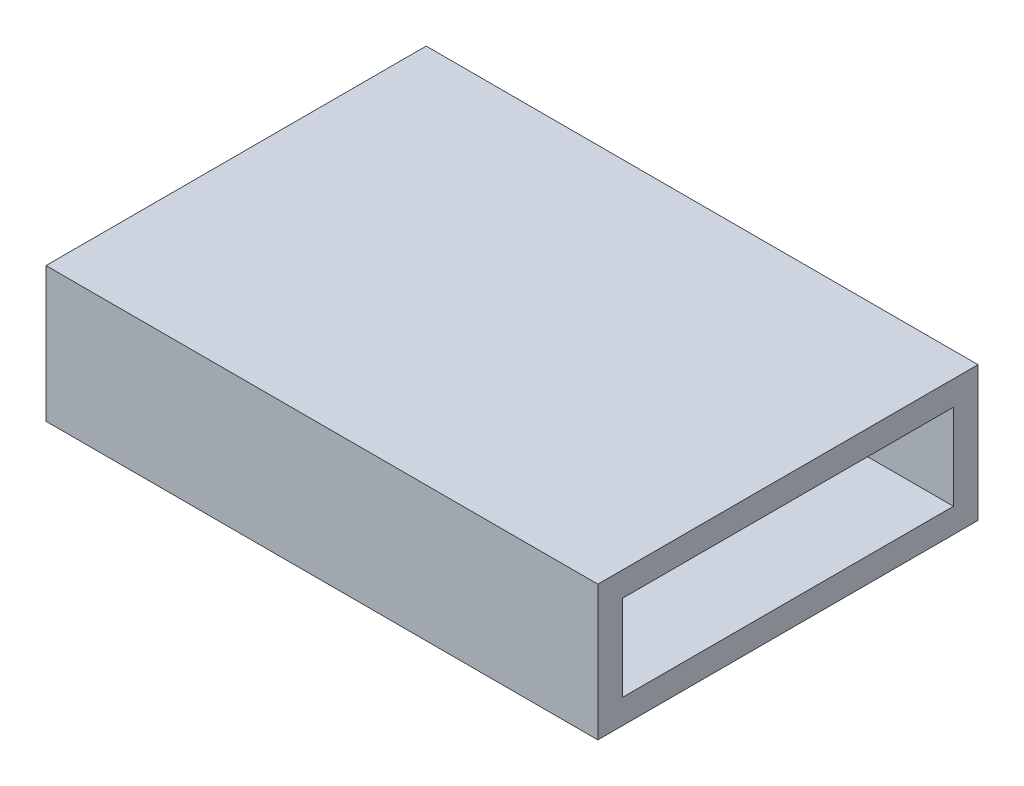
ISO-10303-21;
HEADER;
FILE_DESCRIPTION(('STEP AP214'),'2;1');
FILE_NAME('part.step','',(''),(''),'','','');
FILE_SCHEMA(('AUTOMOTIVE_DESIGN { 1 0 10303 214 1 1 1 1 }'));
ENDSEC;
DATA;
#1=APPLICATION_CONTEXT('core data for automotive mechanical design processes');
#2=APPLICATION_PROTOCOL_DEFINITION('international standard','automotive_design',2000,#1);
#3=PRODUCT_CONTEXT('',#1,'mechanical');
#4=PRODUCT('Part','Part','',(#3));
#5=PRODUCT_RELATED_PRODUCT_CATEGORY('part','',(#4));
#6=PRODUCT_DEFINITION_FORMATION('','',#4);
#7=PRODUCT_DEFINITION_CONTEXT('part definition',#1,'design');
#8=PRODUCT_DEFINITION('design','',#6,#7);
#9=PRODUCT_DEFINITION_SHAPE('','',#8);
#10=(LENGTH_UNIT() NAMED_UNIT(*) SI_UNIT(.MILLI.,.METRE.));
#11=(NAMED_UNIT(*) PLANE_ANGLE_UNIT() SI_UNIT($,.RADIAN.));
#12=(NAMED_UNIT(*) SI_UNIT($,.STERADIAN.) SOLID_ANGLE_UNIT());
#13=UNCERTAINTY_MEASURE_WITH_UNIT(LENGTH_MEASURE(1.E-05),#10,'distance_accuracy_value','');
#14=(GEOMETRIC_REPRESENTATION_CONTEXT(3) GLOBAL_UNCERTAINTY_ASSIGNED_CONTEXT((#13)) GLOBAL_UNIT_ASSIGNED_CONTEXT((#10,
#11,#12)) REPRESENTATION_CONTEXT('',''));
#15=CARTESIAN_POINT('',(0.,0.,0.));
#16=DIRECTION('',(0.,0.,1.));
#17=DIRECTION('',(1.,0.,0.));
#18=AXIS2_PLACEMENT_3D('',#15,#16,#17);
#19=CARTESIAN_POINT('',(-9.,0.,-5.4));
#20=DIRECTION('',(0.,0.,-1.));
#21=DIRECTION('',(-1.,0.,0.));
#22=AXIS2_PLACEMENT_3D('',#19,#20,#21);
#23=PLANE('',#22);
#24=DIRECTION('',(0.,1.,0.));
#25=VECTOR('',#24,1.);
#26=CARTESIAN_POINT('',(-0.5,0.,-5.4));
#27=LINE('',#26,#25);
#28=CARTESIAN_POINT('',(-0.5,-1.4,-5.4));
#29=VERTEX_POINT('',#28);
#30=CARTESIAN_POINT('',(-0.5,0.,-5.4));
#31=VERTEX_POINT('',#30);
#32=EDGE_CURVE('E248',#29,#31,#27,.T.);
#33=ORIENTED_EDGE('',*,*,#32,.T.);
#34=DIRECTION('',(0.,1.,0.));
#35=VECTOR('',#34,1.);
#36=CARTESIAN_POINT('',(-0.5,0.,-5.4));
#37=LINE('',#36,#35);
#38=CARTESIAN_POINT('',(-0.5,1.4,-5.4));
#39=VERTEX_POINT('',#38);
#40=EDGE_CURVE('E296',#31,#39,#37,.T.);
#41=ORIENTED_EDGE('',*,*,#40,.T.);
#42=DIRECTION('',(1.,0.,0.));
#43=VECTOR('',#42,1.);
#44=CARTESIAN_POINT('',(-9.,1.4,-5.4));
#45=LINE('',#44,#43);
#46=CARTESIAN_POINT('',(-9.,1.4,-5.4));
#47=VERTEX_POINT('',#46);
#48=EDGE_CURVE('E384',#47,#39,#45,.T.);
#49=ORIENTED_EDGE('',*,*,#48,.F.);
#50=DIRECTION('',(0.,1.,0.));
#51=VECTOR('',#50,1.);
#52=CARTESIAN_POINT('',(-9.,0.,-5.4));
#53=LINE('',#52,#51);
#54=CARTESIAN_POINT('',(-9.,-1.4,-5.4));
#55=VERTEX_POINT('',#54);
#56=EDGE_CURVE('E355',#55,#47,#53,.T.);
#57=ORIENTED_EDGE('',*,*,#56,.F.);
#58=DIRECTION('',(1.,0.,0.));
#59=VECTOR('',#58,1.);
#60=CARTESIAN_POINT('',(-9.,-1.4,-5.4));
#61=LINE('',#60,#59);
#62=EDGE_CURVE('E395',#55,#29,#61,.T.);
#63=ORIENTED_EDGE('',*,*,#62,.T.);
#64=EDGE_LOOP('',(#33,#41,#49,#57,#63));
#65=FACE_BOUND('',#64,.T.);
#66=ADVANCED_FACE('F107',(#65),#23,.F.);
#67=CARTESIAN_POINT('',(-9.,-1.4,0.));
#68=DIRECTION('',(0.,-1.,0.));
#69=DIRECTION('',(0.,0.,-1.));
#70=AXIS2_PLACEMENT_3D('',#67,#68,#69);
#71=PLANE('',#70);
#72=DIRECTION('',(0.,0.,-1.));
#73=VECTOR('',#72,1.);
#74=CARTESIAN_POINT('',(-0.5,-1.4,0.));
#75=LINE('',#74,#73);
#76=CARTESIAN_POINT('',(-0.5,-1.4,-4.));
#77=VERTEX_POINT('',#76);
#78=EDGE_CURVE('E251',#77,#29,#75,.T.);
#79=ORIENTED_EDGE('',*,*,#78,.T.);
#80=ORIENTED_EDGE('',*,*,#62,.F.);
#81=DIRECTION('',(0.,0.,-1.));
#82=VECTOR('',#81,1.);
#83=CARTESIAN_POINT('',(-9.,-1.4,0.));
#84=LINE('',#83,#82);
#85=CARTESIAN_POINT('',(-9.,-1.4,5.4));
#86=VERTEX_POINT('',#85);
#87=EDGE_CURVE('E357',#86,#55,#84,.T.);
#88=ORIENTED_EDGE('',*,*,#87,.F.);
#89=DIRECTION('',(1.,0.,0.));
#90=VECTOR('',#89,1.);
#91=CARTESIAN_POINT('',(-9.,-1.4,5.4));
#92=LINE('',#91,#90);
#93=CARTESIAN_POINT('',(-0.5,-1.4,5.4));
#94=VERTEX_POINT('',#93);
#95=EDGE_CURVE('E392',#86,#94,#92,.T.);
#96=ORIENTED_EDGE('',*,*,#95,.T.);
#97=DIRECTION('',(0.,0.,-1.));
#98=VECTOR('',#97,1.);
#99=CARTESIAN_POINT('',(-0.5,-1.4,0.));
#100=LINE('',#99,#98);
#101=CARTESIAN_POINT('',(-0.5,-1.4,3.99999999999999));
#102=VERTEX_POINT('',#101);
#103=EDGE_CURVE('E276',#94,#102,#100,.T.);
#104=ORIENTED_EDGE('',*,*,#103,.T.);
#105=DIRECTION('',(-1.,0.,0.));
#106=VECTOR('',#105,1.);
#107=CARTESIAN_POINT('',(0.5,-1.4,3.99999999999999));
#108=LINE('',#107,#106);
#109=CARTESIAN_POINT('',(0.5,-1.4,3.99999999999999));
#110=VERTEX_POINT('',#109);
#111=EDGE_CURVE('E263',#110,#102,#108,.T.);
#112=ORIENTED_EDGE('',*,*,#111,.F.);
#113=DIRECTION('',(0.,0.,-1.));
#114=VECTOR('',#113,1.);
#115=CARTESIAN_POINT('',(0.5,-1.4,0.));
#116=LINE('',#115,#114);
#117=CARTESIAN_POINT('',(0.5,-1.4,5.4));
#118=VERTEX_POINT('',#117);
#119=EDGE_CURVE('E272',#118,#110,#116,.T.);
#120=ORIENTED_EDGE('',*,*,#119,.F.);
#121=CARTESIAN_POINT('',(9.,-1.4,5.4));
#122=VERTEX_POINT('',#121);
#123=EDGE_CURVE('E394',#118,#122,#92,.T.);
#124=ORIENTED_EDGE('',*,*,#123,.T.);
#125=DIRECTION('',(0.,0.,-1.));
#126=VECTOR('',#125,1.);
#127=CARTESIAN_POINT('',(9.,-1.4,0.));
#128=LINE('',#127,#126);
#129=CARTESIAN_POINT('',(9.,-1.4,-5.4));
#130=VERTEX_POINT('',#129);
#131=EDGE_CURVE('E334',#122,#130,#128,.T.);
#132=ORIENTED_EDGE('',*,*,#131,.T.);
#133=CARTESIAN_POINT('',(0.5,-1.4,-5.4));
#134=VERTEX_POINT('',#133);
#135=EDGE_CURVE('E376',#134,#130,#61,.T.);
#136=ORIENTED_EDGE('',*,*,#135,.F.);
#137=DIRECTION('',(0.,0.,-1.));
#138=VECTOR('',#137,1.);
#139=CARTESIAN_POINT('',(0.5,-1.4,0.));
#140=LINE('',#139,#138);
#141=CARTESIAN_POINT('',(0.5,-1.4,-4.));
#142=VERTEX_POINT('',#141);
#143=EDGE_CURVE('E261',#142,#134,#140,.T.);
#144=ORIENTED_EDGE('',*,*,#143,.F.);
#145=DIRECTION('',(1.,0.,0.));
#146=VECTOR('',#145,1.);
#147=CARTESIAN_POINT('',(-0.5,-1.4,-4.));
#148=LINE('',#147,#146);
#149=EDGE_CURVE('E132',#77,#142,#148,.T.);
#150=ORIENTED_EDGE('',*,*,#149,.F.);
#151=EDGE_LOOP('',(#79,#80,#88,#96,#104,#112,#120,#124,#132,#136,#144,#150));
#152=FACE_BOUND('',#151,.T.);
#153=ADVANCED_FACE('F411',(#152),#71,.F.);
#154=CARTESIAN_POINT('',(-9.,0.,5.4));
#155=DIRECTION('',(0.,0.,-1.));
#156=DIRECTION('',(-1.,0.,0.));
#157=AXIS2_PLACEMENT_3D('',#154,#155,#156);
#158=PLANE('',#157);
#159=DIRECTION('',(0.,1.,0.));
#160=VECTOR('',#159,1.);
#161=CARTESIAN_POINT('',(-0.5,0.,5.4));
#162=LINE('',#161,#160);
#163=CARTESIAN_POINT('',(-0.5,0.,5.4));
#164=VERTEX_POINT('',#163);
#165=CARTESIAN_POINT('',(-0.5,1.4,5.4));
#166=VERTEX_POINT('',#165);
#167=EDGE_CURVE('E325',#164,#166,#162,.T.);
#168=ORIENTED_EDGE('',*,*,#167,.F.);
#169=DIRECTION('',(0.,1.,0.));
#170=VECTOR('',#169,1.);
#171=CARTESIAN_POINT('',(-0.5,0.,5.4));
#172=LINE('',#171,#170);
#173=EDGE_CURVE('E271',#94,#164,#172,.T.);
#174=ORIENTED_EDGE('',*,*,#173,.F.);
#175=ORIENTED_EDGE('',*,*,#95,.F.);
#176=DIRECTION('',(0.,1.,0.));
#177=VECTOR('',#176,1.);
#178=CARTESIAN_POINT('',(-9.,0.,5.4));
#179=LINE('',#178,#177);
#180=CARTESIAN_POINT('',(-9.,1.4,5.4));
#181=VERTEX_POINT('',#180);
#182=EDGE_CURVE('E359',#86,#181,#179,.T.);
#183=ORIENTED_EDGE('',*,*,#182,.T.);
#184=DIRECTION('',(1.,0.,0.));
#185=VECTOR('',#184,1.);
#186=CARTESIAN_POINT('',(-9.,1.4,5.4));
#187=LINE('',#186,#185);
#188=EDGE_CURVE('E388',#181,#166,#187,.T.);
#189=ORIENTED_EDGE('',*,*,#188,.T.);
#190=EDGE_LOOP('',(#168,#174,#175,#183,#189));
#191=FACE_BOUND('',#190,.T.);
#192=ADVANCED_FACE('F447',(#191),#158,.T.);
#193=CARTESIAN_POINT('',(-9.,1.4,0.));
#194=DIRECTION('',(0.,-1.,0.));
#195=DIRECTION('',(0.,0.,-1.));
#196=AXIS2_PLACEMENT_3D('',#193,#194,#195);
#197=PLANE('',#196);
#198=DIRECTION('',(0.,0.,-1.));
#199=VECTOR('',#198,1.);
#200=CARTESIAN_POINT('',(5.,1.4,0.));
#201=LINE('',#200,#199);
#202=CARTESIAN_POINT('',(4.99999999999999,1.4,1.5));
#203=VERTEX_POINT('',#202);
#204=CARTESIAN_POINT('',(5.,1.4,-1.5));
#205=VERTEX_POINT('',#204);
#206=EDGE_CURVE('E243',#203,#205,#201,.T.);
#207=ORIENTED_EDGE('',*,*,#206,.F.);
#208=CARTESIAN_POINT('',(4.99999999999999,1.4,1.5));
#209=CARTESIAN_POINT('',(5.0546496268766,1.4,1.46502060856024));
#210=CARTESIAN_POINT('',(5.10896432719781,1.4,1.42950349369793));
#211=CARTESIAN_POINT('',(5.21675456126703,1.4,1.35712803838569));
#212=CARTESIAN_POINT('',(5.27022938413498,1.4,1.32026864105217));
#213=CARTESIAN_POINT('',(5.3777742792628,1.4,1.24379495088444));
#214=CARTESIAN_POINT('',(5.43180870643323,1.4,1.20413025456363));
#215=CARTESIAN_POINT('',(5.53833589281572,1.4,1.12280942165598));
#216=CARTESIAN_POINT('',(5.59082919725743,1.4,1.0811540034079));
#217=CARTESIAN_POINT('',(5.6939581423232,1.4,0.995235560336974));
#218=CARTESIAN_POINT('',(5.74458679887871,1.4,0.950964087041357));
#219=CARTESIAN_POINT('',(5.84305838431086,1.4,0.859289520374277));
#220=CARTESIAN_POINT('',(5.89089841390864,1.4,0.811883273375965));
#221=CARTESIAN_POINT('',(5.9819527092601,1.4,0.713778723707972));
#222=CARTESIAN_POINT('',(6.02521380904108,1.4,0.663124505144372));
#223=CARTESIAN_POINT('',(6.10567157564364,1.4,0.557274101994485));
#224=CARTESIAN_POINT('',(6.14288379948406,1.4,0.502090136387176));
#225=CARTESIAN_POINT('',(6.20174786351954,1.4,0.397889135074331));
#226=CARTESIAN_POINT('',(6.22502127905673,1.4,0.349805005195487));
#227=CARTESIAN_POINT('',(6.26335647476566,1.4,0.250542910172913));
#228=CARTESIAN_POINT('',(6.27845448737729,1.4,0.199379731474378));
#229=CARTESIAN_POINT('',(6.29235032375951,1.4,0.126853292498689));
#230=CARTESIAN_POINT('',(6.29547857181851,1.4,0.106267477162373));
#231=CARTESIAN_POINT('',(6.30276646564085,1.4,0.0406666734203383));
#232=CARTESIAN_POINT('',(6.30384881779305,1.4,-0.00474384132246981));
#233=CARTESIAN_POINT('',(6.29799640478077,1.4,-0.0950717196811475));
#234=CARTESIAN_POINT('',(6.29104813482987,1.4,-0.139988123981029));
#235=CARTESIAN_POINT('',(6.26753149814106,1.4,-0.238498570551946));
#236=CARTESIAN_POINT('',(6.2490777688727,1.4,-0.291634894505645));
#237=CARTESIAN_POINT('',(6.20392369876214,1.4,-0.394263133570797));
#238=CARTESIAN_POINT('',(6.17720422328608,1.4,-0.443746259097651));
#239=CARTESIAN_POINT('',(6.12110214164838,1.4,-0.534003622351125));
#240=CARTESIAN_POINT('',(6.09229692883771,1.4,-0.575146088191978));
#241=CARTESIAN_POINT('',(6.03127346710114,1.4,-0.654840320205034));
#242=CARTESIAN_POINT('',(5.99905204318933,1.4,-0.693389620973979));
#243=CARTESIAN_POINT('',(5.89829975608361,1.4,-0.806113189365541));
#244=CARTESIAN_POINT('',(5.8259976546959,1.4,-0.876897243778261));
#245=CARTESIAN_POINT('',(5.69214161103487,1.4,-0.997192774017794));
#246=CARTESIAN_POINT('',(5.63168355830302,1.4,-1.04797638984672));
#247=CARTESIAN_POINT('',(5.50825401234864,1.4,-1.14648637173923));
#248=CARTESIAN_POINT('',(5.44528079824551,1.4,-1.19421058430993));
#249=CARTESIAN_POINT('',(5.31922264919171,1.4,-1.28600494731339));
#250=CARTESIAN_POINT('',(5.25618275675281,1.4,-1.3301376910483));
#251=CARTESIAN_POINT('',(5.12891303614758,1.4,-1.41642523372126));
#252=CARTESIAN_POINT('',(5.06468535885684,1.4,-1.45858319688228));
#253=CARTESIAN_POINT('',(5.,1.4,-1.5));
#254=B_SPLINE_CURVE_WITH_KNOTS('',3,(#208,#209,#210,#211,#212,#213,#214,#215,#216,#217,#218,
#219,#220,#221,#222,#223,#224,#225,#226,#227,#228,#229,#230,#231,#232,#233,#234,#235,#236,#237,
#238,#239,#240,#241,#242,#243,#244,#245,#246,#247,#248,#249,#250,#251,#252,#253),.UNSPECIFIED.,
.F.,.F.,(4,2,2,2,2,2,2,2,2,2,2,2,2,2,2,2,2,2,2,2,2,2,4),(0.,0.194665234315559,0.389487206432667,
0.590538990219365,0.791518765658653,0.993187421689024,1.19506214011325,1.39461732682554,
1.59365086964885,1.75339624308493,1.91242772528098,1.97485345693437,2.11033486388824,
2.24604443658924,2.41382451595574,2.58199593846983,2.7324447600478,2.88303465344687,
3.1858887354926,3.42267832759246,3.65963280448135,3.89045677438785,4.12089726811317),.UNSPECIFIED.);
#255=EDGE_CURVE('E12',#203,#205,#254,.T.);
#256=ORIENTED_EDGE('',*,*,#255,.T.);
#257=EDGE_LOOP('',(#207,#256));
#258=FACE_BOUND('',#257,.T.);
#259=DIRECTION('',(0.,0.,-1.));
#260=VECTOR('',#259,1.);
#261=CARTESIAN_POINT('',(0.5,1.4,0.));
#262=LINE('',#261,#260);
#263=CARTESIAN_POINT('',(0.5,1.4,-4.));
#264=VERTEX_POINT('',#263);
#265=CARTESIAN_POINT('',(0.5,1.4,-5.4));
#266=VERTEX_POINT('',#265);
#267=EDGE_CURVE('E298',#264,#266,#262,.T.);
#268=ORIENTED_EDGE('',*,*,#267,.T.);
#269=CARTESIAN_POINT('',(9.,1.4,-5.4));
#270=VERTEX_POINT('',#269);
#271=EDGE_CURVE('E387',#266,#270,#45,.T.);
#272=ORIENTED_EDGE('',*,*,#271,.T.);
#273=DIRECTION('',(0.,0.,-1.));
#274=VECTOR('',#273,1.);
#275=CARTESIAN_POINT('',(9.,1.4,0.));
#276=LINE('',#275,#274);
#277=CARTESIAN_POINT('',(9.,1.4,5.4));
#278=VERTEX_POINT('',#277);
#279=EDGE_CURVE('E340',#278,#270,#276,.T.);
#280=ORIENTED_EDGE('',*,*,#279,.F.);
#281=CARTESIAN_POINT('',(0.5,1.4,5.4));
#282=VERTEX_POINT('',#281);
#283=EDGE_CURVE('E391',#282,#278,#187,.T.);
#284=ORIENTED_EDGE('',*,*,#283,.F.);
#285=DIRECTION('',(0.,0.,-1.));
#286=VECTOR('',#285,1.);
#287=CARTESIAN_POINT('',(0.5,1.4,0.));
#288=LINE('',#287,#286);
#289=CARTESIAN_POINT('',(0.5,1.4,3.99999999999999));
#290=VERTEX_POINT('',#289);
#291=EDGE_CURVE('E315',#282,#290,#288,.T.);
#292=ORIENTED_EDGE('',*,*,#291,.T.);
#293=DIRECTION('',(1.,0.,0.));
#294=VECTOR('',#293,1.);
#295=CARTESIAN_POINT('',(-0.5,1.4,3.99999999999999));
#296=LINE('',#295,#294);
#297=CARTESIAN_POINT('',(-0.5,1.4,3.99999999999999));
#298=VERTEX_POINT('',#297);
#299=EDGE_CURVE('E328',#298,#290,#296,.T.);
#300=ORIENTED_EDGE('',*,*,#299,.F.);
#301=DIRECTION('',(0.,0.,-1.));
#302=VECTOR('',#301,1.);
#303=CARTESIAN_POINT('',(-0.5,1.4,0.));
#304=LINE('',#303,#302);
#305=EDGE_CURVE('E322',#166,#298,#304,.T.);
#306=ORIENTED_EDGE('',*,*,#305,.F.);
#307=ORIENTED_EDGE('',*,*,#188,.F.);
#308=DIRECTION('',(0.,0.,-1.));
#309=VECTOR('',#308,1.);
#310=CARTESIAN_POINT('',(-9.,1.4,0.));
#311=LINE('',#310,#309);
#312=EDGE_CURVE('E362',#181,#47,#311,.T.);
#313=ORIENTED_EDGE('',*,*,#312,.T.);
#314=ORIENTED_EDGE('',*,*,#48,.T.);
#315=DIRECTION('',(0.,0.,-1.));
#316=VECTOR('',#315,1.);
#317=CARTESIAN_POINT('',(-0.5,1.4,0.));
#318=LINE('',#317,#316);
#319=CARTESIAN_POINT('',(-0.5,1.4,-4.));
#320=VERTEX_POINT('',#319);
#321=EDGE_CURVE('E275',#320,#39,#318,.T.);
#322=ORIENTED_EDGE('',*,*,#321,.F.);
#323=DIRECTION('',(-1.,0.,0.));
#324=VECTOR('',#323,1.);
#325=CARTESIAN_POINT('',(0.5,1.4,-4.));
#326=LINE('',#325,#324);
#327=EDGE_CURVE('E309',#264,#320,#326,.T.);
#328=ORIENTED_EDGE('',*,*,#327,.F.);
#329=EDGE_LOOP('',(#268,#272,#280,#284,#292,#300,#306,#307,#313,#314,#322,#328));
#330=FACE_BOUND('',#329,.T.);
#331=ADVANCED_FACE('F241',(#258,#330),#197,.T.);
#332=DIRECTION('',(0.,1.,0.));
#333=VECTOR('',#332,1.);
#334=CARTESIAN_POINT('',(0.5,0.,5.4));
#335=LINE('',#334,#333);
#336=CARTESIAN_POINT('',(0.5,0.,5.4));
#337=VERTEX_POINT('',#336);
#338=EDGE_CURVE('E278',#118,#337,#335,.T.);
#339=ORIENTED_EDGE('',*,*,#338,.T.);
#340=DIRECTION('',(0.,1.,0.));
#341=VECTOR('',#340,1.);
#342=CARTESIAN_POINT('',(0.5,0.,5.4));
#343=LINE('',#342,#341);
#344=EDGE_CURVE('E317',#337,#282,#343,.T.);
#345=ORIENTED_EDGE('',*,*,#344,.T.);
#346=ORIENTED_EDGE('',*,*,#283,.T.);
#347=DIRECTION('',(0.,1.,0.));
#348=VECTOR('',#347,1.);
#349=CARTESIAN_POINT('',(9.,0.,5.4));
#350=LINE('',#349,#348);
#351=EDGE_CURVE('E337',#122,#278,#350,.T.);
#352=ORIENTED_EDGE('',*,*,#351,.F.);
#353=ORIENTED_EDGE('',*,*,#123,.F.);
#354=EDGE_LOOP('',(#339,#345,#346,#352,#353));
#355=FACE_BOUND('',#354,.T.);
#356=ADVANCED_FACE('F416',(#355),#158,.T.);
#357=CARTESIAN_POINT('',(-9.,0.,6.2));
#358=DIRECTION('',(0.,0.,-1.));
#359=DIRECTION('',(-1.,0.,0.));
#360=AXIS2_PLACEMENT_3D('',#357,#358,#359);
#361=PLANE('',#360);
#362=DIRECTION('',(1.,0.,0.));
#363=VECTOR('',#362,1.);
#364=CARTESIAN_POINT('',(-9.,-2.2,6.2));
#365=LINE('',#364,#363);
#366=CARTESIAN_POINT('',(-9.,-2.2,6.2));
#367=VERTEX_POINT('',#366);
#368=CARTESIAN_POINT('',(9.,-2.2,6.2));
#369=VERTEX_POINT('',#368);
#370=EDGE_CURVE('E382',#367,#369,#365,.T.);
#371=ORIENTED_EDGE('',*,*,#370,.T.);
#372=DIRECTION('',(0.,1.,0.));
#373=VECTOR('',#372,1.);
#374=CARTESIAN_POINT('',(9.,0.,6.2));
#375=LINE('',#374,#373);
#376=CARTESIAN_POINT('',(9.,2.2,6.2));
#377=VERTEX_POINT('',#376);
#378=EDGE_CURVE('E343',#369,#377,#375,.T.);
#379=ORIENTED_EDGE('',*,*,#378,.T.);
#380=DIRECTION('',(1.,0.,0.));
#381=VECTOR('',#380,1.);
#382=CARTESIAN_POINT('',(-9.,2.2,6.2));
#383=LINE('',#382,#381);
#384=CARTESIAN_POINT('',(-9.,2.2,6.2));
#385=VERTEX_POINT('',#384);
#386=EDGE_CURVE('E120',#385,#377,#383,.T.);
#387=ORIENTED_EDGE('',*,*,#386,.F.);
#388=DIRECTION('',(0.,1.,0.));
#389=VECTOR('',#388,1.);
#390=CARTESIAN_POINT('',(-9.,0.,6.2));
#391=LINE('',#390,#389);
#392=EDGE_CURVE('E365',#367,#385,#391,.T.);
#393=ORIENTED_EDGE('',*,*,#392,.F.);
#394=EDGE_LOOP('',(#371,#379,#387,#393));
#395=FACE_BOUND('',#394,.T.);
#396=ADVANCED_FACE('F465',(#395),#361,.F.);
#397=CARTESIAN_POINT('',(-9.,2.2,0.));
#398=DIRECTION('',(0.,-1.,0.));
#399=DIRECTION('',(0.,0.,-1.));
#400=AXIS2_PLACEMENT_3D('',#397,#398,#399);
#401=PLANE('',#400);
#402=ORIENTED_EDGE('',*,*,#386,.T.);
#403=DIRECTION('',(0.,0.,-1.));
#404=VECTOR('',#403,1.);
#405=CARTESIAN_POINT('',(9.,2.2,0.));
#406=LINE('',#405,#404);
#407=CARTESIAN_POINT('',(9.,2.2,-6.2));
#408=VERTEX_POINT('',#407);
#409=EDGE_CURVE('E352',#377,#408,#406,.T.);
#410=ORIENTED_EDGE('',*,*,#409,.T.);
#411=DIRECTION('',(1.,0.,0.));
#412=VECTOR('',#411,1.);
#413=CARTESIAN_POINT('',(-9.,2.2,-6.2));
#414=LINE('',#413,#412);
#415=CARTESIAN_POINT('',(-9.,2.2,-6.2));
#416=VERTEX_POINT('',#415);
#417=EDGE_CURVE('E378',#416,#408,#414,.T.);
#418=ORIENTED_EDGE('',*,*,#417,.F.);
#419=DIRECTION('',(0.,0.,-1.));
#420=VECTOR('',#419,1.);
#421=CARTESIAN_POINT('',(-9.,2.2,0.));
#422=LINE('',#421,#420);
#423=EDGE_CURVE('E374',#385,#416,#422,.T.);
#424=ORIENTED_EDGE('',*,*,#423,.F.);
#425=EDGE_LOOP('',(#402,#410,#418,#424));
#426=FACE_BOUND('',#425,.T.);
#427=ADVANCED_FACE('F459',(#426),#401,.F.);
#428=CARTESIAN_POINT('',(-9.,0.,-6.2));
#429=DIRECTION('',(0.,0.,-1.));
#430=DIRECTION('',(0.,1.,0.));
#431=AXIS2_PLACEMENT_3D('',#428,#429,#430);
#432=PLANE('',#431);
#433=ORIENTED_EDGE('',*,*,#417,.T.);
#434=DIRECTION('',(0.,1.,0.));
#435=VECTOR('',#434,1.);
#436=CARTESIAN_POINT('',(9.,0.,-6.2));
#437=LINE('',#436,#435);
#438=CARTESIAN_POINT('',(9.,-2.2,-6.2));
#439=VERTEX_POINT('',#438);
#440=EDGE_CURVE('E349',#439,#408,#437,.T.);
#441=ORIENTED_EDGE('',*,*,#440,.F.);
#442=DIRECTION('',(1.,0.,0.));
#443=VECTOR('',#442,1.);
#444=CARTESIAN_POINT('',(-9.,-2.2,-6.2));
#445=LINE('',#444,#443);
#446=CARTESIAN_POINT('',(-9.,-2.2,-6.2));
#447=VERTEX_POINT('',#446);
#448=EDGE_CURVE('E380',#447,#439,#445,.T.);
#449=ORIENTED_EDGE('',*,*,#448,.F.);
#450=DIRECTION('',(0.,1.,0.));
#451=VECTOR('',#450,1.);
#452=CARTESIAN_POINT('',(-9.,0.,-6.2));
#453=LINE('',#452,#451);
#454=EDGE_CURVE('E371',#447,#416,#453,.T.);
#455=ORIENTED_EDGE('',*,*,#454,.T.);
#456=EDGE_LOOP('',(#433,#441,#449,#455));
#457=FACE_BOUND('',#456,.T.);
#458=ADVANCED_FACE('F451',(#457),#432,.T.);
#459=DIRECTION('',(0.,1.,0.));
#460=VECTOR('',#459,1.);
#461=CARTESIAN_POINT('',(0.5,0.,-5.4));
#462=LINE('',#461,#460);
#463=CARTESIAN_POINT('',(0.5,0.,-5.4));
#464=VERTEX_POINT('',#463);
#465=EDGE_CURVE('E303',#464,#266,#462,.T.);
#466=ORIENTED_EDGE('',*,*,#465,.F.);
#467=DIRECTION('',(0.,1.,0.));
#468=VECTOR('',#467,1.);
#469=CARTESIAN_POINT('',(0.5,0.,-5.4));
#470=LINE('',#469,#468);
#471=EDGE_CURVE('E254',#134,#464,#470,.T.);
#472=ORIENTED_EDGE('',*,*,#471,.F.);
#473=ORIENTED_EDGE('',*,*,#135,.T.);
#474=DIRECTION('',(0.,1.,0.));
#475=VECTOR('',#474,1.);
#476=CARTESIAN_POINT('',(9.,0.,-5.4));
#477=LINE('',#476,#475);
#478=EDGE_CURVE('E331',#130,#270,#477,.T.);
#479=ORIENTED_EDGE('',*,*,#478,.T.);
#480=ORIENTED_EDGE('',*,*,#271,.F.);
#481=EDGE_LOOP('',(#466,#472,#473,#479,#480));
#482=FACE_BOUND('',#481,.T.);
#483=ADVANCED_FACE('F404',(#482),#23,.F.);
#484=CARTESIAN_POINT('',(-9.,-2.2,0.));
#485=DIRECTION('',(0.,-1.,0.));
#486=DIRECTION('',(0.,0.,-1.));
#487=AXIS2_PLACEMENT_3D('',#484,#485,#486);
#488=PLANE('',#487);
#489=ORIENTED_EDGE('',*,*,#448,.T.);
#490=DIRECTION('',(0.,0.,-1.));
#491=VECTOR('',#490,1.);
#492=CARTESIAN_POINT('',(9.,-2.2,0.));
#493=LINE('',#492,#491);
#494=EDGE_CURVE('E346',#369,#439,#493,.T.);
#495=ORIENTED_EDGE('',*,*,#494,.F.);
#496=ORIENTED_EDGE('',*,*,#370,.F.);
#497=DIRECTION('',(0.,0.,-1.));
#498=VECTOR('',#497,1.);
#499=CARTESIAN_POINT('',(-9.,-2.2,0.));
#500=LINE('',#499,#498);
#501=EDGE_CURVE('E368',#367,#447,#500,.T.);
#502=ORIENTED_EDGE('',*,*,#501,.T.);
#503=EDGE_LOOP('',(#489,#495,#496,#502));
#504=FACE_BOUND('',#503,.T.);
#505=ADVANCED_FACE('F450',(#504),#488,.T.);
#506=CARTESIAN_POINT('',(-9.,0.,0.));
#507=DIRECTION('',(1.,0.,0.));
#508=DIRECTION('',(0.,0.,-1.));
#509=AXIS2_PLACEMENT_3D('',#506,#507,#508);
#510=PLANE('',#509);
#511=ORIENTED_EDGE('',*,*,#56,.T.);
#512=ORIENTED_EDGE('',*,*,#312,.F.);
#513=ORIENTED_EDGE('',*,*,#182,.F.);
#514=ORIENTED_EDGE('',*,*,#87,.T.);
#515=EDGE_LOOP('',(#511,#512,#513,#514));
#516=FACE_BOUND('',#515,.T.);
#517=ORIENTED_EDGE('',*,*,#392,.T.);
#518=ORIENTED_EDGE('',*,*,#423,.T.);
#519=ORIENTED_EDGE('',*,*,#454,.F.);
#520=ORIENTED_EDGE('',*,*,#501,.F.);
#521=EDGE_LOOP('',(#517,#518,#519,#520));
#522=FACE_BOUND('',#521,.T.);
#523=ADVANCED_FACE('F456',(#516,#522),#510,.F.);
#524=CARTESIAN_POINT('',(9.,0.,0.));
#525=DIRECTION('',(1.,0.,0.));
#526=DIRECTION('',(0.,0.,-1.));
#527=AXIS2_PLACEMENT_3D('',#524,#525,#526);
#528=PLANE('',#527);
#529=ORIENTED_EDGE('',*,*,#478,.F.);
#530=ORIENTED_EDGE('',*,*,#131,.F.);
#531=ORIENTED_EDGE('',*,*,#351,.T.);
#532=ORIENTED_EDGE('',*,*,#279,.T.);
#533=EDGE_LOOP('',(#529,#530,#531,#532));
#534=FACE_BOUND('',#533,.T.);
#535=ORIENTED_EDGE('',*,*,#378,.F.);
#536=ORIENTED_EDGE('',*,*,#494,.T.);
#537=ORIENTED_EDGE('',*,*,#440,.T.);
#538=ORIENTED_EDGE('',*,*,#409,.F.);
#539=EDGE_LOOP('',(#535,#536,#537,#538));
#540=FACE_BOUND('',#539,.T.);
#541=ADVANCED_FACE('F408',(#534,#540),#528,.T.);
#542=CARTESIAN_POINT('',(-0.5,2.7,2.69999999999999));
#543=DIRECTION('',(0.,0.707106781186549,0.707106781186546));
#544=DIRECTION('',(0.,-0.707106781186546,0.707106781186549));
#545=AXIS2_PLACEMENT_3D('',#542,#543,#544);
#546=PLANE('',#545);
#547=DIRECTION('',(0.,-0.707106781186546,0.707106781186549));
#548=VECTOR('',#547,1.);
#549=CARTESIAN_POINT('',(0.5,2.7,2.69999999999999));
#550=LINE('',#549,#548);
#551=EDGE_CURVE('E312',#290,#337,#550,.T.);
#552=ORIENTED_EDGE('',*,*,#551,.T.);
#553=DIRECTION('',(-1.,0.,0.));
#554=VECTOR('',#553,1.);
#555=CARTESIAN_POINT('',(0.5,0.,5.4));
#556=LINE('',#555,#554);
#557=EDGE_CURVE('E282',#337,#164,#556,.T.);
#558=ORIENTED_EDGE('',*,*,#557,.T.);
#559=DIRECTION('',(0.,-0.707106781186546,0.707106781186549));
#560=VECTOR('',#559,1.);
#561=CARTESIAN_POINT('',(-0.5,2.7,2.69999999999999));
#562=LINE('',#561,#560);
#563=EDGE_CURVE('E319',#298,#164,#562,.T.);
#564=ORIENTED_EDGE('',*,*,#563,.F.);
#565=ORIENTED_EDGE('',*,*,#299,.T.);
#566=EDGE_LOOP('',(#552,#558,#564,#565));
#567=FACE_BOUND('',#566,.T.);
#568=ADVANCED_FACE('F487',(#567),#546,.F.);
#569=CARTESIAN_POINT('',(-0.5,0.,0.));
#570=DIRECTION('',(1.,0.,0.));
#571=DIRECTION('',(0.,0.,-1.));
#572=AXIS2_PLACEMENT_3D('',#569,#570,#571);
#573=PLANE('',#572);
#574=ORIENTED_EDGE('',*,*,#563,.T.);
#575=ORIENTED_EDGE('',*,*,#167,.T.);
#576=ORIENTED_EDGE('',*,*,#305,.T.);
#577=EDGE_LOOP('',(#574,#575,#576));
#578=FACE_BOUND('',#577,.T.);
#579=ADVANCED_FACE('F484',(#578),#573,.F.);
#580=CARTESIAN_POINT('',(0.5,0.,0.));
#581=DIRECTION('',(1.,0.,0.));
#582=DIRECTION('',(0.,0.,-1.));
#583=AXIS2_PLACEMENT_3D('',#580,#581,#582);
#584=PLANE('',#583);
#585=ORIENTED_EDGE('',*,*,#551,.F.);
#586=ORIENTED_EDGE('',*,*,#291,.F.);
#587=ORIENTED_EDGE('',*,*,#344,.F.);
#588=EDGE_LOOP('',(#585,#586,#587));
#589=FACE_BOUND('',#588,.T.);
#590=ADVANCED_FACE('F499',(#589),#584,.T.);
#591=CARTESIAN_POINT('',(0.5,2.7,-2.69999999999999));
#592=DIRECTION('',(0.,0.707106781186549,-0.707106781186546));
#593=DIRECTION('',(0.,0.707106781186546,0.707106781186549));
#594=AXIS2_PLACEMENT_3D('',#591,#592,#593);
#595=PLANE('',#594);
#596=ORIENTED_EDGE('',*,*,#327,.T.);
#597=DIRECTION('',(0.,-0.707106781186546,-0.707106781186549));
#598=VECTOR('',#597,1.);
#599=CARTESIAN_POINT('',(-0.5,2.7,-2.69999999999999));
#600=LINE('',#599,#598);
#601=EDGE_CURVE('E293',#320,#31,#600,.T.);
#602=ORIENTED_EDGE('',*,*,#601,.T.);
#603=DIRECTION('',(-1.,0.,0.));
#604=VECTOR('',#603,1.);
#605=CARTESIAN_POINT('',(0.5,0.,-5.4));
#606=LINE('',#605,#604);
#607=EDGE_CURVE('E306',#464,#31,#606,.T.);
#608=ORIENTED_EDGE('',*,*,#607,.F.);
#609=DIRECTION('',(0.,-0.707106781186546,-0.707106781186549));
#610=VECTOR('',#609,1.);
#611=CARTESIAN_POINT('',(0.5,2.7,-2.69999999999999));
#612=LINE('',#611,#610);
#613=EDGE_CURVE('E300',#264,#464,#612,.T.);
#614=ORIENTED_EDGE('',*,*,#613,.F.);
#615=EDGE_LOOP('',(#596,#602,#608,#614));
#616=FACE_BOUND('',#615,.T.);
#617=ADVANCED_FACE('F426',(#616),#595,.F.);
#618=CARTESIAN_POINT('',(0.5,0.,0.));
#619=DIRECTION('',(1.,0.,0.));
#620=DIRECTION('',(0.,0.,-1.));
#621=AXIS2_PLACEMENT_3D('',#618,#619,#620);
#622=PLANE('',#621);
#623=ORIENTED_EDGE('',*,*,#267,.F.);
#624=ORIENTED_EDGE('',*,*,#613,.T.);
#625=ORIENTED_EDGE('',*,*,#465,.T.);
#626=EDGE_LOOP('',(#623,#624,#625));
#627=FACE_BOUND('',#626,.T.);
#628=ADVANCED_FACE('F421',(#627),#622,.T.);
#629=CARTESIAN_POINT('',(-0.5,0.,0.));
#630=DIRECTION('',(1.,0.,0.));
#631=DIRECTION('',(0.,0.,-1.));
#632=AXIS2_PLACEMENT_3D('',#629,#630,#631);
#633=PLANE('',#632);
#634=ORIENTED_EDGE('',*,*,#321,.T.);
#635=ORIENTED_EDGE('',*,*,#40,.F.);
#636=ORIENTED_EDGE('',*,*,#601,.F.);
#637=EDGE_LOOP('',(#634,#635,#636));
#638=FACE_BOUND('',#637,.T.);
#639=ADVANCED_FACE('F507',(#638),#633,.F.);
#640=CARTESIAN_POINT('',(0.5,-2.7,2.69999999999999));
#641=DIRECTION('',(0.,0.707106781186549,-0.707106781186546));
#642=DIRECTION('',(0.,0.707106781186546,0.707106781186549));
#643=AXIS2_PLACEMENT_3D('',#640,#641,#642);
#644=PLANE('',#643);
#645=ORIENTED_EDGE('',*,*,#111,.T.);
#646=DIRECTION('',(0.,-0.707106781186546,-0.707106781186549));
#647=VECTOR('',#646,1.);
#648=CARTESIAN_POINT('',(-0.5,-2.7,2.69999999999999));
#649=LINE('',#648,#647);
#650=EDGE_CURVE('E268',#164,#102,#649,.T.);
#651=ORIENTED_EDGE('',*,*,#650,.F.);
#652=ORIENTED_EDGE('',*,*,#557,.F.);
#653=DIRECTION('',(0.,-0.707106781186546,-0.707106781186549));
#654=VECTOR('',#653,1.);
#655=CARTESIAN_POINT('',(0.5,-2.7,2.69999999999999));
#656=LINE('',#655,#654);
#657=EDGE_CURVE('E279',#337,#110,#656,.T.);
#658=ORIENTED_EDGE('',*,*,#657,.T.);
#659=EDGE_LOOP('',(#645,#651,#652,#658));
#660=FACE_BOUND('',#659,.T.);
#661=ADVANCED_FACE('F495',(#660),#644,.T.);
#662=CARTESIAN_POINT('',(0.5,0.,0.));
#663=DIRECTION('',(1.,0.,0.));
#664=DIRECTION('',(0.,0.,-1.));
#665=AXIS2_PLACEMENT_3D('',#662,#663,#664);
#666=PLANE('',#665);
#667=ORIENTED_EDGE('',*,*,#657,.F.);
#668=ORIENTED_EDGE('',*,*,#338,.F.);
#669=ORIENTED_EDGE('',*,*,#119,.T.);
#670=EDGE_LOOP('',(#667,#668,#669));
#671=FACE_BOUND('',#670,.T.);
#672=ADVANCED_FACE('F497',(#671),#666,.T.);
#673=CARTESIAN_POINT('',(-0.5,0.,0.));
#674=DIRECTION('',(1.,0.,0.));
#675=DIRECTION('',(0.,0.,-1.));
#676=AXIS2_PLACEMENT_3D('',#673,#674,#675);
#677=PLANE('',#676);
#678=ORIENTED_EDGE('',*,*,#650,.T.);
#679=ORIENTED_EDGE('',*,*,#103,.F.);
#680=ORIENTED_EDGE('',*,*,#173,.T.);
#681=EDGE_LOOP('',(#678,#679,#680));
#682=FACE_BOUND('',#681,.T.);
#683=ADVANCED_FACE('F494',(#682),#677,.F.);
#684=CARTESIAN_POINT('',(-0.5,-2.7,-2.69999999999999));
#685=DIRECTION('',(0.,0.707106781186549,0.707106781186546));
#686=DIRECTION('',(0.,-0.707106781186546,0.707106781186549));
#687=AXIS2_PLACEMENT_3D('',#684,#685,#686);
#688=PLANE('',#687);
#689=ORIENTED_EDGE('',*,*,#149,.T.);
#690=DIRECTION('',(0.,-0.707106781186546,0.707106781186549));
#691=VECTOR('',#690,1.);
#692=CARTESIAN_POINT('',(0.5,-2.7,-2.69999999999999));
#693=LINE('',#692,#691);
#694=EDGE_CURVE('E257',#464,#142,#693,.T.);
#695=ORIENTED_EDGE('',*,*,#694,.F.);
#696=ORIENTED_EDGE('',*,*,#607,.T.);
#697=DIRECTION('',(0.,-0.707106781186546,0.707106781186549));
#698=VECTOR('',#697,1.);
#699=CARTESIAN_POINT('',(-0.5,-2.7,-2.69999999999999));
#700=LINE('',#699,#698);
#701=EDGE_CURVE('E258',#31,#77,#700,.T.);
#702=ORIENTED_EDGE('',*,*,#701,.T.);
#703=EDGE_LOOP('',(#689,#695,#696,#702));
#704=FACE_BOUND('',#703,.T.);
#705=ADVANCED_FACE('F430',(#704),#688,.T.);
#706=CARTESIAN_POINT('',(-0.5,0.,0.));
#707=DIRECTION('',(1.,0.,0.));
#708=DIRECTION('',(0.,0.,-1.));
#709=AXIS2_PLACEMENT_3D('',#706,#707,#708);
#710=PLANE('',#709);
#711=ORIENTED_EDGE('',*,*,#32,.F.);
#712=ORIENTED_EDGE('',*,*,#78,.F.);
#713=ORIENTED_EDGE('',*,*,#701,.F.);
#714=EDGE_LOOP('',(#711,#712,#713));
#715=FACE_BOUND('',#714,.T.);
#716=ADVANCED_FACE('F434',(#715),#710,.F.);
#717=CARTESIAN_POINT('',(0.5,0.,0.));
#718=DIRECTION('',(1.,0.,0.));
#719=DIRECTION('',(0.,0.,-1.));
#720=AXIS2_PLACEMENT_3D('',#717,#718,#719);
#721=PLANE('',#720);
#722=ORIENTED_EDGE('',*,*,#471,.T.);
#723=ORIENTED_EDGE('',*,*,#694,.T.);
#724=ORIENTED_EDGE('',*,*,#143,.T.);
#725=EDGE_LOOP('',(#722,#723,#724));
#726=FACE_BOUND('',#725,.T.);
#727=ADVANCED_FACE('F432',(#726),#721,.T.);
#728=CARTESIAN_POINT('',(5.,0.,0.));
#729=DIRECTION('',(1.,0.,0.));
#730=DIRECTION('',(0.,0.,-1.));
#731=AXIS2_PLACEMENT_3D('',#728,#729,#730);
#732=PLANE('',#731);
#733=ORIENTED_EDGE('',*,*,#206,.T.);
#734=CARTESIAN_POINT('',(5.,3.4,0.));
#735=DIRECTION('',(1.,0.,0.));
#736=DIRECTION('',(0.,0.,-1.));
#737=AXIS2_PLACEMENT_3D('',#734,#735,#736);
#738=CIRCLE('',#737,2.5);
#739=EDGE_CURVE('E246',#203,#205,#738,.T.);
#740=ORIENTED_EDGE('',*,*,#739,.F.);
#741=EDGE_LOOP('',(#733,#740));
#742=FACE_BOUND('',#741,.T.);
#743=ADVANCED_FACE('F245',(#742),#732,.F.);
#744=CARTESIAN_POINT('',(7.,3.4,0.));
#745=DIRECTION('',(-1.,0.,0.));
#746=DIRECTION('',(0.,0.,1.));
#747=AXIS2_PLACEMENT_3D('',#744,#745,#746);
#748=CONICAL_SURFACE('',#747,1.73227192992915,0.366519142918816);
#749=ORIENTED_EDGE('',*,*,#255,.F.);
#750=ORIENTED_EDGE('',*,*,#739,.T.);
#751=EDGE_LOOP('',(#749,#750));
#752=FACE_BOUND('',#751,.T.);
#753=ADVANCED_FACE('F109',(#752),#748,.T.);
#754=CLOSED_SHELL('',(#66,#153,#192,#331,#356,#396,#427,#458,#483,#505,#523,#541,#568,#579,#590,
#617,#628,#639,#661,#672,#683,#705,#716,#727,#743,#753));
#755=MANIFOLD_SOLID_BREP('B2',#754);
#756=ADVANCED_BREP_SHAPE_REPRESENTATION('',(#18,#755),#14);
#757=SHAPE_DEFINITION_REPRESENTATION(#9,#756);
ENDSEC;
END-ISO-10303-21;
